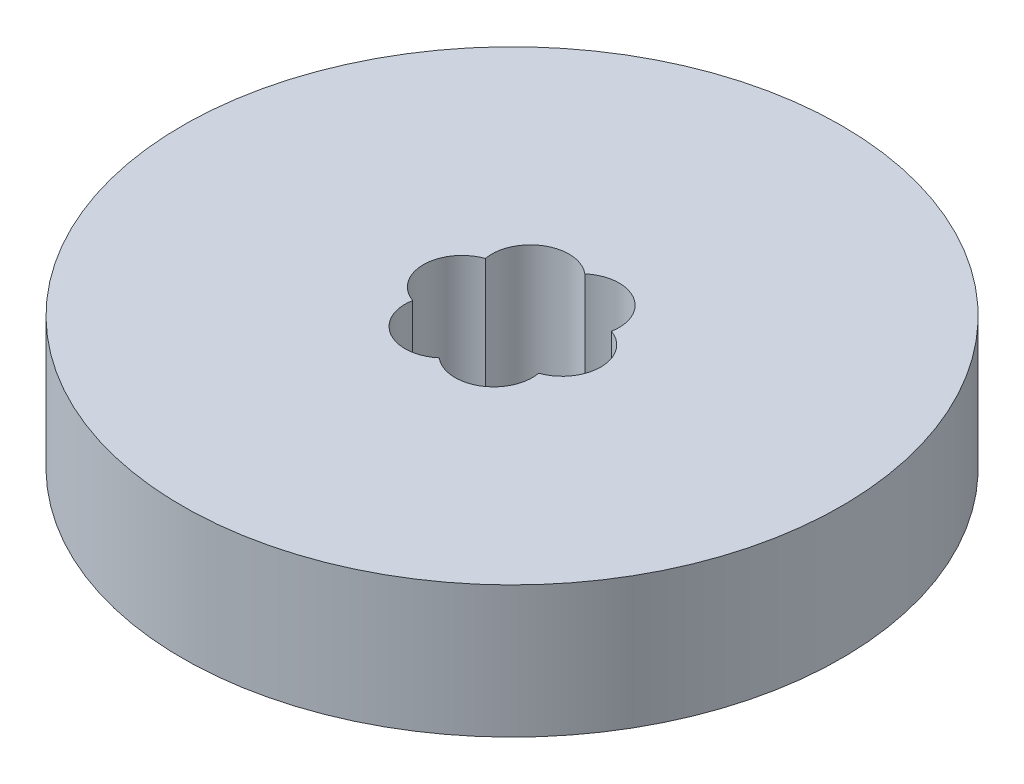
ISO-10303-21;
HEADER;
FILE_DESCRIPTION(('STEP AP214'),'2;1');
FILE_NAME('part.step','',(''),(''),'','','');
FILE_SCHEMA(('AUTOMOTIVE_DESIGN { 1 0 10303 214 1 1 1 1 }'));
ENDSEC;
DATA;
#1=APPLICATION_CONTEXT('core data for automotive mechanical design processes');
#2=APPLICATION_PROTOCOL_DEFINITION('international standard','automotive_design',2000,#1);
#3=PRODUCT_CONTEXT('',#1,'mechanical');
#4=PRODUCT('Part','Part','',(#3));
#5=PRODUCT_RELATED_PRODUCT_CATEGORY('part','',(#4));
#6=PRODUCT_DEFINITION_FORMATION('','',#4);
#7=PRODUCT_DEFINITION_CONTEXT('part definition',#1,'design');
#8=PRODUCT_DEFINITION('design','',#6,#7);
#9=PRODUCT_DEFINITION_SHAPE('','',#8);
#10=(LENGTH_UNIT() NAMED_UNIT(*) SI_UNIT(.MILLI.,.METRE.));
#11=(NAMED_UNIT(*) PLANE_ANGLE_UNIT() SI_UNIT($,.RADIAN.));
#12=(NAMED_UNIT(*) SI_UNIT($,.STERADIAN.) SOLID_ANGLE_UNIT());
#13=UNCERTAINTY_MEASURE_WITH_UNIT(LENGTH_MEASURE(1.E-05),#10,'distance_accuracy_value','');
#14=(GEOMETRIC_REPRESENTATION_CONTEXT(3) GLOBAL_UNCERTAINTY_ASSIGNED_CONTEXT((#13)) GLOBAL_UNIT_ASSIGNED_CONTEXT((#10,
#11,#12)) REPRESENTATION_CONTEXT('',''));
#15=CARTESIAN_POINT('',(0.,0.,0.));
#16=DIRECTION('',(0.,0.,1.));
#17=DIRECTION('',(1.,0.,0.));
#18=AXIS2_PLACEMENT_3D('',#15,#16,#17);
#19=CARTESIAN_POINT('',(0.,13.,0.));
#20=DIRECTION('',(0.,-1.,0.));
#21=DIRECTION('',(0.,0.,-1.));
#22=AXIS2_PLACEMENT_3D('',#19,#20,#21);
#23=CYLINDRICAL_SURFACE('',#22,5.);
#24=CARTESIAN_POINT('',(0.,0.,0.));
#25=DIRECTION('',(0.,1.,0.));
#26=DIRECTION('',(0.,0.,1.));
#27=AXIS2_PLACEMENT_3D('',#24,#25,#26);
#28=CIRCLE('',#27,5.);
#29=CARTESIAN_POINT('',(0.,0.,-5.));
#30=VERTEX_POINT('',#29);
#31=EDGE_CURVE('E142',#30,#30,#28,.T.);
#32=CARTESIAN_POINT('',(0.,0.152622896054144,0.));
#33=DIRECTION('',(0.,1.,0.));
#34=DIRECTION('',(0.,0.,1.));
#35=AXIS2_PLACEMENT_3D('',#32,#33,#34);
#36=CIRCLE('',#35,5.);
#37=CARTESIAN_POINT('',(0.,0.152622896054142,-5.));
#38=VERTEX_POINT('',#37);
#39=EDGE_CURVE('E11',#38,#38,#36,.T.);
#40=CARTESIAN_POINT('',(0.,0.,-5.));
#41=CARTESIAN_POINT('',(0.,0.00158982183389757,-5.));
#42=CARTESIAN_POINT('',(0.,0.00317964366779513,-5.));
#43=CARTESIAN_POINT('',(0.,0.00635928733558969,-5.));
#44=CARTESIAN_POINT('',(0.,0.00794910916948668,-5.));
#45=CARTESIAN_POINT('',(0.,0.0111287528372812,-5.));
#46=CARTESIAN_POINT('',(0.,0.0127185746711788,-5.));
#47=CARTESIAN_POINT('',(0.,0.0158982183389734,-5.));
#48=CARTESIAN_POINT('',(0.,0.0174880401728703,-5.));
#49=CARTESIAN_POINT('',(0.,0.0206676838406649,-5.));
#50=CARTESIAN_POINT('',(0.,0.0222575056745625,-5.));
#51=CARTESIAN_POINT('',(0.,0.025437149342357,-5.));
#52=CARTESIAN_POINT('',(0.,0.027026971176254,-5.));
#53=CARTESIAN_POINT('',(0.,0.0302066148440486,-5.));
#54=CARTESIAN_POINT('',(0.,0.0317964366779461,-5.));
#55=CARTESIAN_POINT('',(0.,0.0349760803457407,-5.));
#56=CARTESIAN_POINT('',(0.,0.0365659021796377,-5.));
#57=CARTESIAN_POINT('',(0.,0.0397455458474322,-5.));
#58=CARTESIAN_POINT('',(0.,0.0413353676813298,-5.));
#59=CARTESIAN_POINT('',(0.,0.0445150113491249,-5.));
#60=CARTESIAN_POINT('',(0.,0.0461048331830225,-5.));
#61=CARTESIAN_POINT('',(0.,0.0492844768508171,-5.));
#62=CARTESIAN_POINT('',(0.,0.0508742986847141,-5.));
#63=CARTESIAN_POINT('',(0.,0.0540539423525086,-5.));
#64=CARTESIAN_POINT('',(0.,0.0556437641864062,-5.));
#65=CARTESIAN_POINT('',(0.,0.0588234078542007,-5.));
#66=CARTESIAN_POINT('',(0.,0.0604132296880977,-5.));
#67=CARTESIAN_POINT('',(0.,0.0635928733558923,-5.));
#68=CARTESIAN_POINT('',(0.,0.0651826951897898,-5.));
#69=CARTESIAN_POINT('',(0.,0.0683623388575844,-5.));
#70=CARTESIAN_POINT('',(0.,0.0699521606914814,-5.));
#71=CARTESIAN_POINT('',(0.,0.073131804359276,-5.));
#72=CARTESIAN_POINT('',(0.,0.0747216261931735,-5.));
#73=CARTESIAN_POINT('',(0.,0.0779012698609687,-5.));
#74=CARTESIAN_POINT('',(0.,0.0794910916948662,-5.));
#75=CARTESIAN_POINT('',(0.,0.0826707353626608,-5.));
#76=CARTESIAN_POINT('',(0.,0.0842605571965578,-5.));
#77=CARTESIAN_POINT('',(0.,0.0874402008643523,-5.));
#78=CARTESIAN_POINT('',(0.,0.0890300226982499,-5.));
#79=CARTESIAN_POINT('',(0.,0.0922096663660444,-5.));
#80=CARTESIAN_POINT('',(0.,0.0937994881999414,-5.));
#81=CARTESIAN_POINT('',(0.,0.096979131867736,-5.));
#82=CARTESIAN_POINT('',(0.,0.0985689537016336,-5.));
#83=CARTESIAN_POINT('',(0.,0.101748597369428,-5.));
#84=CARTESIAN_POINT('',(0.,0.103338419203325,-5.));
#85=CARTESIAN_POINT('',(0.,0.10651806287112,-5.));
#86=CARTESIAN_POINT('',(0.,0.108107884705017,-5.));
#87=CARTESIAN_POINT('',(0.,0.111287528372812,-5.));
#88=CARTESIAN_POINT('',(0.,0.11287735020671,-5.));
#89=CARTESIAN_POINT('',(0.,0.116056993874504,-5.));
#90=CARTESIAN_POINT('',(0.,0.117646815708401,-5.));
#91=CARTESIAN_POINT('',(0.,0.120826459376196,-5.));
#92=CARTESIAN_POINT('',(0.,0.122416281210094,-5.));
#93=CARTESIAN_POINT('',(0.,0.125595924877888,-5.));
#94=CARTESIAN_POINT('',(0.,0.127185746711785,-5.));
#95=CARTESIAN_POINT('',(0.,0.13036539037958,-5.));
#96=CARTESIAN_POINT('',(0.,0.131955212213477,-5.));
#97=CARTESIAN_POINT('',(0.,0.135134855881272,-5.));
#98=CARTESIAN_POINT('',(0.,0.136724677715169,-5.));
#99=CARTESIAN_POINT('',(0.,0.139904321382963,-5.));
#100=CARTESIAN_POINT('',(0.,0.141494143216861,-5.));
#101=CARTESIAN_POINT('',(0.,0.144673786884655,-5.));
#102=CARTESIAN_POINT('',(0.,0.146263608718552,-5.));
#103=CARTESIAN_POINT('',(0.,0.149443252386347,-5.));
#104=CARTESIAN_POINT('',(0.,0.151033074220245,-5.));
#105=CARTESIAN_POINT('',(0.,0.152622896054142,-5.));
#106=B_SPLINE_CURVE_WITH_KNOTS('',3,(#40,#41,#42,#43,#44,#45,#46,#47,#48,#49,#50,#51,#52,#53,
#54,#55,#56,#57,#58,#59,#60,#61,#62,#63,#64,#65,#66,#67,#68,#69,#70,#71,#72,#73,#74,#75,#76,#77,
#78,#79,#80,#81,#82,#83,#84,#85,#86,#87,#88,#89,#90,#91,#92,#93,#94,#95,#96,#97,#98,#99,#100,
#101,#102,#103,#104,#105),.UNSPECIFIED.,.F.,.F.,(4,2,2,2,2,2,2,2,2,2,2,2,2,2,2,2,2,2,2,2,2,2,2,
2,2,2,2,2,2,2,2,2,4),(0.,0.0047694655016927,0.00953893100338367,0.0143083965050764,
0.0190778620067673,0.02384732750846,0.028616793010151,0.0333862585118437,0.0381557240135347,
0.0429251895152274,0.0476946550169201,0.052464120518611,0.0572335860203037,0.0620030515219947,
0.0667725170236874,0.0715419825253784,0.0763114480270711,0.0810809135287638,0.0858503790304548,
0.0906198445321475,0.0953893100338384,0.100158775535531,0.104928241037222,0.109697706538915,
0.114467172040607,0.119236637542298,0.124006103043991,0.128775568545682,0.133545034047375,
0.138314499549066,0.143083965050758,0.147853430552449,0.152622896054142),.UNSPECIFIED.);
#107=EDGE_CURVE('BSEAM39',#30,#38,#106,.T.);
#108=ORIENTED_EDGE('',*,*,#31,.F.);
#109=ORIENTED_EDGE('',*,*,#39,.T.);
#110=ORIENTED_EDGE('',*,*,#107,.T.);
#111=ORIENTED_EDGE('',*,*,#107,.F.);
#112=EDGE_LOOP('',(#108,#110,#109,#111));
#113=FACE_BOUND('',#112,.T.);
#114=ADVANCED_FACE('F39',(#113),#23,.F.);
#115=CARTESIAN_POINT('',(0.,13.,0.));
#116=DIRECTION('',(0.,-1.,0.));
#117=DIRECTION('',(0.,0.,-1.));
#118=AXIS2_PLACEMENT_3D('',#115,#116,#117);
#119=CYLINDRICAL_SURFACE('',#118,32.5);
#120=CARTESIAN_POINT('',(0.,13.,0.));
#121=DIRECTION('',(0.,1.,0.));
#122=DIRECTION('',(0.,0.,1.));
#123=AXIS2_PLACEMENT_3D('',#120,#121,#122);
#124=CIRCLE('',#123,32.5);
#125=CARTESIAN_POINT('',(0.,13.,-32.5));
#126=VERTEX_POINT('',#125);
#127=EDGE_CURVE('E50',#126,#126,#124,.T.);
#128=CARTESIAN_POINT('',(0.,0.,0.));
#129=DIRECTION('',(0.,1.,0.));
#130=DIRECTION('',(0.,0.,1.));
#131=AXIS2_PLACEMENT_3D('',#128,#129,#130);
#132=CIRCLE('',#131,32.5);
#133=CARTESIAN_POINT('',(0.,0.,-32.5));
#134=VERTEX_POINT('',#133);
#135=EDGE_CURVE('E150',#134,#134,#132,.T.);
#136=CARTESIAN_POINT('',(0.,13.,-32.5));
#137=CARTESIAN_POINT('',(0.,12.8645833333333,-32.5));
#138=CARTESIAN_POINT('',(0.,12.7291666666667,-32.5));
#139=CARTESIAN_POINT('',(0.,12.4583333333333,-32.5));
#140=CARTESIAN_POINT('',(0.,12.3229166666667,-32.5));
#141=CARTESIAN_POINT('',(0.,12.0520833333333,-32.5));
#142=CARTESIAN_POINT('',(0.,11.9166666666667,-32.5));
#143=CARTESIAN_POINT('',(0.,11.6458333333333,-32.5));
#144=CARTESIAN_POINT('',(0.,11.5104166666667,-32.5));
#145=CARTESIAN_POINT('',(0.,11.2395833333333,-32.5));
#146=CARTESIAN_POINT('',(0.,11.1041666666667,-32.5));
#147=CARTESIAN_POINT('',(0.,10.8333333333333,-32.5));
#148=CARTESIAN_POINT('',(0.,10.6979166666667,-32.5));
#149=CARTESIAN_POINT('',(0.,10.4270833333333,-32.5));
#150=CARTESIAN_POINT('',(0.,10.2916666666667,-32.5));
#151=CARTESIAN_POINT('',(0.,10.0208333333333,-32.5));
#152=CARTESIAN_POINT('',(0.,9.88541666666667,-32.5));
#153=CARTESIAN_POINT('',(0.,9.61458333333333,-32.5));
#154=CARTESIAN_POINT('',(0.,9.47916666666667,-32.5));
#155=CARTESIAN_POINT('',(0.,9.20833333333333,-32.5));
#156=CARTESIAN_POINT('',(0.,9.07291666666667,-32.5));
#157=CARTESIAN_POINT('',(0.,8.80208333333333,-32.5));
#158=CARTESIAN_POINT('',(0.,8.66666666666667,-32.5));
#159=CARTESIAN_POINT('',(0.,8.39583333333333,-32.5));
#160=CARTESIAN_POINT('',(0.,8.26041666666667,-32.5));
#161=CARTESIAN_POINT('',(0.,7.98958333333333,-32.5));
#162=CARTESIAN_POINT('',(0.,7.85416666666667,-32.5));
#163=CARTESIAN_POINT('',(0.,7.58333333333333,-32.5));
#164=CARTESIAN_POINT('',(0.,7.44791666666667,-32.5));
#165=CARTESIAN_POINT('',(0.,7.17708333333333,-32.5));
#166=CARTESIAN_POINT('',(0.,7.04166666666667,-32.5));
#167=CARTESIAN_POINT('',(0.,6.77083333333333,-32.5));
#168=CARTESIAN_POINT('',(0.,6.63541666666667,-32.5));
#169=CARTESIAN_POINT('',(0.,6.36458333333333,-32.5));
#170=CARTESIAN_POINT('',(0.,6.22916666666667,-32.5));
#171=CARTESIAN_POINT('',(0.,5.95833333333333,-32.5));
#172=CARTESIAN_POINT('',(0.,5.82291666666667,-32.5));
#173=CARTESIAN_POINT('',(0.,5.55208333333333,-32.5));
#174=CARTESIAN_POINT('',(0.,5.41666666666667,-32.5));
#175=CARTESIAN_POINT('',(0.,5.14583333333333,-32.5));
#176=CARTESIAN_POINT('',(0.,5.01041666666667,-32.5));
#177=CARTESIAN_POINT('',(0.,4.73958333333333,-32.5));
#178=CARTESIAN_POINT('',(0.,4.60416666666667,-32.5));
#179=CARTESIAN_POINT('',(0.,4.33333333333333,-32.5));
#180=CARTESIAN_POINT('',(0.,4.19791666666667,-32.5));
#181=CARTESIAN_POINT('',(0.,3.92708333333333,-32.5));
#182=CARTESIAN_POINT('',(0.,3.79166666666667,-32.5));
#183=CARTESIAN_POINT('',(0.,3.52083333333333,-32.5));
#184=CARTESIAN_POINT('',(0.,3.38541666666667,-32.5));
#185=CARTESIAN_POINT('',(0.,3.11458333333333,-32.5));
#186=CARTESIAN_POINT('',(0.,2.97916666666667,-32.5));
#187=CARTESIAN_POINT('',(0.,2.70833333333333,-32.5));
#188=CARTESIAN_POINT('',(0.,2.57291666666667,-32.5));
#189=CARTESIAN_POINT('',(0.,2.30208333333333,-32.5));
#190=CARTESIAN_POINT('',(0.,2.16666666666667,-32.5));
#191=CARTESIAN_POINT('',(0.,1.89583333333333,-32.5));
#192=CARTESIAN_POINT('',(0.,1.76041666666667,-32.5));
#193=CARTESIAN_POINT('',(0.,1.48958333333333,-32.5));
#194=CARTESIAN_POINT('',(0.,1.35416666666667,-32.5));
#195=CARTESIAN_POINT('',(0.,1.08333333333333,-32.5));
#196=CARTESIAN_POINT('',(0.,0.947916666666667,-32.5));
#197=CARTESIAN_POINT('',(0.,0.677083333333334,-32.5));
#198=CARTESIAN_POINT('',(0.,0.541666666666667,-32.5));
#199=CARTESIAN_POINT('',(0.,0.270833333333334,-32.5));
#200=CARTESIAN_POINT('',(0.,0.135416666666667,-32.5));
#201=CARTESIAN_POINT('',(0.,0.,-32.5));
#202=B_SPLINE_CURVE_WITH_KNOTS('',3,(#136,#137,#138,#139,#140,#141,#142,#143,#144,#145,#146,
#147,#148,#149,#150,#151,#152,#153,#154,#155,#156,#157,#158,#159,#160,#161,#162,#163,#164,#165,
#166,#167,#168,#169,#170,#171,#172,#173,#174,#175,#176,#177,#178,#179,#180,#181,#182,#183,#184,
#185,#186,#187,#188,#189,#190,#191,#192,#193,#194,#195,#196,#197,#198,#199,#200,#201),
.UNSPECIFIED.,.F.,.F.,(4,2,2,2,2,2,2,2,2,2,2,2,2,2,2,2,2,2,2,2,2,2,2,2,2,2,2,2,2,2,2,2,4),(0.,
0.406249999999999,0.812499999999999,1.21875,1.625,2.03125,2.4375,2.84375,3.25,3.65625,4.0625,
4.46875,4.875,5.28125,5.6875,6.09375,6.5,6.90625,7.3125,7.71875,8.125,8.53125,8.9375,9.34375,
9.75,10.15625,10.5625,10.96875,11.375,11.78125,12.1875,12.59375,13.),.UNSPECIFIED.);
#203=EDGE_CURVE('BSEAM41',#126,#134,#202,.T.);
#204=ORIENTED_EDGE('',*,*,#127,.F.);
#205=ORIENTED_EDGE('',*,*,#135,.T.);
#206=ORIENTED_EDGE('',*,*,#203,.T.);
#207=ORIENTED_EDGE('',*,*,#203,.F.);
#208=EDGE_LOOP('',(#204,#206,#205,#207));
#209=FACE_BOUND('',#208,.T.);
#210=ADVANCED_FACE('F41',(#209),#119,.T.);
#211=CARTESIAN_POINT('',(0.,13.,0.));
#212=DIRECTION('',(0.,1.,0.));
#213=DIRECTION('',(0.,0.,1.));
#214=AXIS2_PLACEMENT_3D('',#211,#212,#213);
#215=PLANE('',#214);
#216=CARTESIAN_POINT('',(-2.47074132439483,13.,4.27944950621189));
#217=DIRECTION('',(0.,1.,0.));
#218=DIRECTION('',(0.86602540378444,0.,0.499999999999998));
#219=AXIS2_PLACEMENT_3D('',#216,#217,#218);
#220=CIRCLE('',#219,3.80807382384419);
#221=CARTESIAN_POINT('',(-6.21562342646082,13.,3.58859185844851));
#222=VERTEX_POINT('',#221);
#223=CARTESIAN_POINT('',(0.,13.,7.177183716897));
#224=VERTEX_POINT('',#223);
#225=EDGE_CURVE('E132',#222,#224,#220,.T.);
#226=ORIENTED_EDGE('',*,*,#225,.F.);
#227=CARTESIAN_POINT('',(-4.94148264878968,13.,0.));
#228=DIRECTION('',(0.,1.,0.));
#229=DIRECTION('',(0.,0.,1.));
#230=AXIS2_PLACEMENT_3D('',#227,#228,#229);
#231=CIRCLE('',#230,3.80807382384419);
#232=CARTESIAN_POINT('',(-6.21562342646088,13.,-3.58859185844848));
#233=VERTEX_POINT('',#232);
#234=EDGE_CURVE('E138',#233,#222,#231,.T.);
#235=ORIENTED_EDGE('',*,*,#234,.F.);
#236=CARTESIAN_POINT('',(-2.47074132439489,13.,-4.27944950621185));
#237=DIRECTION('',(0.,1.,0.));
#238=DIRECTION('',(-0.866025403784433,0.,0.50000000000001));
#239=AXIS2_PLACEMENT_3D('',#236,#237,#238);
#240=CIRCLE('',#239,3.80807382384419);
#241=CARTESIAN_POINT('',(0.,13.,-7.177183716897));
#242=VERTEX_POINT('',#241);
#243=EDGE_CURVE('E53',#242,#233,#240,.T.);
#244=ORIENTED_EDGE('',*,*,#243,.F.);
#245=CARTESIAN_POINT('',(2.4707413243948,13.,-4.2794495062119));
#246=DIRECTION('',(0.,1.,0.));
#247=DIRECTION('',(-0.866025403784443,0.,-0.499999999999992));
#248=AXIS2_PLACEMENT_3D('',#245,#246,#247);
#249=CIRCLE('',#248,3.80807382384419);
#250=CARTESIAN_POINT('',(6.21562342646078,13.,-3.58859185844852));
#251=VERTEX_POINT('',#250);
#252=EDGE_CURVE('E106',#251,#242,#249,.T.);
#253=ORIENTED_EDGE('',*,*,#252,.F.);
#254=CARTESIAN_POINT('',(4.94148264878968,13.,0.));
#255=DIRECTION('',(0.,1.,0.));
#256=DIRECTION('',(0.,0.,-1.));
#257=AXIS2_PLACEMENT_3D('',#254,#255,#256);
#258=CIRCLE('',#257,3.80807382384419);
#259=CARTESIAN_POINT('',(6.21562342646085,13.,3.5885918584485));
#260=VERTEX_POINT('',#259);
#261=EDGE_CURVE('E104',#260,#251,#258,.T.);
#262=ORIENTED_EDGE('',*,*,#261,.F.);
#263=CARTESIAN_POINT('',(2.47074132439486,13.,4.27944950621187));
#264=DIRECTION('',(0.,1.,0.));
#265=DIRECTION('',(0.866025403784436,0.,-0.500000000000004));
#266=AXIS2_PLACEMENT_3D('',#263,#264,#265);
#267=CIRCLE('',#266,3.80807382384419);
#268=EDGE_CURVE('E123',#224,#260,#267,.T.);
#269=ORIENTED_EDGE('',*,*,#268,.F.);
#270=EDGE_LOOP('',(#226,#235,#244,#253,#262,#269));
#271=FACE_BOUND('',#270,.T.);
#272=ORIENTED_EDGE('',*,*,#127,.T.);
#273=EDGE_LOOP('',(#272));
#274=FACE_BOUND('',#273,.T.);
#275=ADVANCED_FACE('F156',(#271,#274),#215,.T.);
#276=CARTESIAN_POINT('',(0.,0.,0.));
#277=DIRECTION('',(0.,1.,0.));
#278=DIRECTION('',(0.,0.,1.));
#279=AXIS2_PLACEMENT_3D('',#276,#277,#278);
#280=PLANE('',#279);
#281=ORIENTED_EDGE('',*,*,#31,.T.);
#282=EDGE_LOOP('',(#281));
#283=FACE_BOUND('',#282,.T.);
#284=ORIENTED_EDGE('',*,*,#135,.F.);
#285=EDGE_LOOP('',(#284));
#286=FACE_BOUND('',#285,.T.);
#287=ADVANCED_FACE('F153',(#283,#286),#280,.F.);
#288=CARTESIAN_POINT('',(-4.94148264878968,0.152622896054144,0.));
#289=DIRECTION('',(0.,1.,0.));
#290=DIRECTION('',(0.,0.,1.));
#291=AXIS2_PLACEMENT_3D('',#288,#289,#290);
#292=CYLINDRICAL_SURFACE('',#291,3.80807382384419);
#293=ORIENTED_EDGE('',*,*,#234,.T.);
#294=DIRECTION('',(0.,1.,0.));
#295=VECTOR('',#294,1.);
#296=CARTESIAN_POINT('',(-6.21562342646082,6.57631144802707,3.58859185844851));
#297=LINE('',#296,#295);
#298=CARTESIAN_POINT('',(-6.21562342646082,0.152622896054144,3.58859185844851));
#299=VERTEX_POINT('',#298);
#300=EDGE_CURVE('E65',#222,#299,#297,.F.);
#301=ORIENTED_EDGE('',*,*,#300,.T.);
#302=CARTESIAN_POINT('',(-4.94148264878968,0.152622896054144,0.));
#303=DIRECTION('',(0.,1.,0.));
#304=DIRECTION('',(0.,0.,1.));
#305=AXIS2_PLACEMENT_3D('',#302,#303,#304);
#306=CIRCLE('',#305,3.80807382384419);
#307=CARTESIAN_POINT('',(-6.21562342646088,0.152622896054144,-3.58859185844848));
#308=VERTEX_POINT('',#307);
#309=EDGE_CURVE('E139',#308,#299,#306,.T.);
#310=ORIENTED_EDGE('',*,*,#309,.F.);
#311=DIRECTION('',(0.,1.,0.));
#312=VECTOR('',#311,1.);
#313=CARTESIAN_POINT('',(-6.21562342646088,6.57631144802707,-3.58859185844848));
#314=LINE('',#313,#312);
#315=EDGE_CURVE('E114',#308,#233,#314,.T.);
#316=ORIENTED_EDGE('',*,*,#315,.T.);
#317=EDGE_LOOP('',(#293,#301,#310,#316));
#318=FACE_BOUND('',#317,.T.);
#319=ADVANCED_FACE('F154',(#318),#292,.F.);
#320=CARTESIAN_POINT('',(-4.94148264878968,0.152622896054144,0.));
#321=DIRECTION('',(0.,1.,0.));
#322=DIRECTION('',(0.,0.,1.));
#323=AXIS2_PLACEMENT_3D('',#320,#321,#322);
#324=PLANE('',#323);
#325=ORIENTED_EDGE('',*,*,#309,.T.);
#326=CARTESIAN_POINT('',(-2.47074132439483,0.152622896054144,4.27944950621189));
#327=DIRECTION('',(0.,1.,0.));
#328=DIRECTION('',(0.86602540378444,0.,0.499999999999998));
#329=AXIS2_PLACEMENT_3D('',#326,#327,#328);
#330=CIRCLE('',#329,3.80807382384419);
#331=CARTESIAN_POINT('',(0.,0.152622896054144,7.177183716897));
#332=VERTEX_POINT('',#331);
#333=EDGE_CURVE('E133',#299,#332,#330,.T.);
#334=ORIENTED_EDGE('',*,*,#333,.T.);
#335=CARTESIAN_POINT('',(2.47074132439486,0.152622896054144,4.27944950621187));
#336=DIRECTION('',(0.,1.,0.));
#337=DIRECTION('',(0.866025403784436,0.,-0.500000000000004));
#338=AXIS2_PLACEMENT_3D('',#335,#336,#337);
#339=CIRCLE('',#338,3.80807382384419);
#340=CARTESIAN_POINT('',(6.21562342646085,0.152622896054144,3.5885918584485));
#341=VERTEX_POINT('',#340);
#342=EDGE_CURVE('E124',#332,#341,#339,.T.);
#343=ORIENTED_EDGE('',*,*,#342,.T.);
#344=CARTESIAN_POINT('',(4.94148264878968,0.152622896054144,0.));
#345=DIRECTION('',(0.,1.,0.));
#346=DIRECTION('',(0.,0.,-1.));
#347=AXIS2_PLACEMENT_3D('',#344,#345,#346);
#348=CIRCLE('',#347,3.80807382384419);
#349=CARTESIAN_POINT('',(6.21562342646078,0.152622896054144,-3.58859185844852));
#350=VERTEX_POINT('',#349);
#351=EDGE_CURVE('E105',#341,#350,#348,.T.);
#352=ORIENTED_EDGE('',*,*,#351,.T.);
#353=CARTESIAN_POINT('',(2.4707413243948,0.152622896054144,-4.2794495062119));
#354=DIRECTION('',(0.,1.,0.));
#355=DIRECTION('',(-0.866025403784443,0.,-0.499999999999992));
#356=AXIS2_PLACEMENT_3D('',#353,#354,#355);
#357=CIRCLE('',#356,3.80807382384419);
#358=CARTESIAN_POINT('',(0.,0.152622896054144,-7.177183716897));
#359=VERTEX_POINT('',#358);
#360=EDGE_CURVE('E91',#350,#359,#357,.T.);
#361=ORIENTED_EDGE('',*,*,#360,.T.);
#362=CARTESIAN_POINT('',(-2.47074132439489,0.152622896054144,-4.27944950621185));
#363=DIRECTION('',(0.,1.,0.));
#364=DIRECTION('',(-0.866025403784433,0.,0.50000000000001));
#365=AXIS2_PLACEMENT_3D('',#362,#363,#364);
#366=CIRCLE('',#365,3.80807382384419);
#367=EDGE_CURVE('E97',#359,#308,#366,.T.);
#368=ORIENTED_EDGE('',*,*,#367,.T.);
#369=EDGE_LOOP('',(#325,#334,#343,#352,#361,#368));
#370=FACE_BOUND('',#369,.T.);
#371=ORIENTED_EDGE('',*,*,#39,.F.);
#372=EDGE_LOOP('',(#371));
#373=FACE_BOUND('',#372,.T.);
#374=ADVANCED_FACE('F96',(#370,#373),#324,.T.);
#375=CARTESIAN_POINT('',(-2.47074132439483,0.152622896054144,4.27944950621189));
#376=DIRECTION('',(0.,1.,0.));
#377=DIRECTION('',(0.,0.,1.));
#378=AXIS2_PLACEMENT_3D('',#375,#376,#377);
#379=CYLINDRICAL_SURFACE('',#378,3.80807382384419);
#380=ORIENTED_EDGE('',*,*,#225,.T.);
#381=DIRECTION('',(0.,1.,0.));
#382=VECTOR('',#381,1.);
#383=CARTESIAN_POINT('',(0.,6.57631144802707,7.177183716897));
#384=LINE('',#383,#382);
#385=EDGE_CURVE('E128',#224,#332,#384,.F.);
#386=ORIENTED_EDGE('',*,*,#385,.T.);
#387=ORIENTED_EDGE('',*,*,#333,.F.);
#388=ORIENTED_EDGE('',*,*,#300,.F.);
#389=EDGE_LOOP('',(#380,#386,#387,#388));
#390=FACE_BOUND('',#389,.T.);
#391=ADVANCED_FACE('F177',(#390),#379,.F.);
#392=CARTESIAN_POINT('',(-2.47074132439489,0.152622896054144,-4.27944950621185));
#393=DIRECTION('',(0.,1.,0.));
#394=DIRECTION('',(0.,0.,1.));
#395=AXIS2_PLACEMENT_3D('',#392,#393,#394);
#396=CYLINDRICAL_SURFACE('',#395,3.80807382384419);
#397=ORIENTED_EDGE('',*,*,#367,.F.);
#398=DIRECTION('',(0.,1.,0.));
#399=VECTOR('',#398,1.);
#400=CARTESIAN_POINT('',(0.,6.57631144802707,-7.177183716897));
#401=LINE('',#400,#399);
#402=EDGE_CURVE('E107',#242,#359,#401,.F.);
#403=ORIENTED_EDGE('',*,*,#402,.F.);
#404=ORIENTED_EDGE('',*,*,#243,.T.);
#405=ORIENTED_EDGE('',*,*,#315,.F.);
#406=EDGE_LOOP('',(#397,#403,#404,#405));
#407=FACE_BOUND('',#406,.T.);
#408=ADVANCED_FACE('F115',(#407),#396,.F.);
#409=CARTESIAN_POINT('',(2.47074132439486,0.152622896054144,4.27944950621187));
#410=DIRECTION('',(0.,1.,0.));
#411=DIRECTION('',(0.,0.,1.));
#412=AXIS2_PLACEMENT_3D('',#409,#410,#411);
#413=CYLINDRICAL_SURFACE('',#412,3.80807382384419);
#414=ORIENTED_EDGE('',*,*,#268,.T.);
#415=DIRECTION('',(0.,1.,0.));
#416=VECTOR('',#415,1.);
#417=CARTESIAN_POINT('',(6.21562342646085,6.57631144802707,3.5885918584485));
#418=LINE('',#417,#416);
#419=EDGE_CURVE('E118',#260,#341,#418,.F.);
#420=ORIENTED_EDGE('',*,*,#419,.T.);
#421=ORIENTED_EDGE('',*,*,#342,.F.);
#422=ORIENTED_EDGE('',*,*,#385,.F.);
#423=EDGE_LOOP('',(#414,#420,#421,#422));
#424=FACE_BOUND('',#423,.T.);
#425=ADVANCED_FACE('F182',(#424),#413,.F.);
#426=CARTESIAN_POINT('',(4.94148264878968,0.152622896054144,0.));
#427=DIRECTION('',(0.,1.,0.));
#428=DIRECTION('',(0.,0.,1.));
#429=AXIS2_PLACEMENT_3D('',#426,#427,#428);
#430=CYLINDRICAL_SURFACE('',#429,3.80807382384419);
#431=DIRECTION('',(0.,1.,0.));
#432=VECTOR('',#431,1.);
#433=CARTESIAN_POINT('',(6.21562342646079,6.57631144802707,-3.58859185844852));
#434=LINE('',#433,#432);
#435=EDGE_CURVE('E130',#251,#350,#434,.F.);
#436=ORIENTED_EDGE('',*,*,#435,.T.);
#437=ORIENTED_EDGE('',*,*,#351,.F.);
#438=ORIENTED_EDGE('',*,*,#419,.F.);
#439=ORIENTED_EDGE('',*,*,#261,.T.);
#440=EDGE_LOOP('',(#436,#437,#438,#439));
#441=FACE_BOUND('',#440,.T.);
#442=ADVANCED_FACE('F184',(#441),#430,.F.);
#443=CARTESIAN_POINT('',(2.4707413243948,0.152622896054144,-4.2794495062119));
#444=DIRECTION('',(0.,1.,0.));
#445=DIRECTION('',(0.,0.,1.));
#446=AXIS2_PLACEMENT_3D('',#443,#444,#445);
#447=CYLINDRICAL_SURFACE('',#446,3.80807382384419);
#448=ORIENTED_EDGE('',*,*,#252,.T.);
#449=ORIENTED_EDGE('',*,*,#402,.T.);
#450=ORIENTED_EDGE('',*,*,#360,.F.);
#451=ORIENTED_EDGE('',*,*,#435,.F.);
#452=EDGE_LOOP('',(#448,#449,#450,#451));
#453=FACE_BOUND('',#452,.T.);
#454=ADVANCED_FACE('F108',(#453),#447,.F.);
#455=CLOSED_SHELL('',(#114,#210,#275,#287,#319,#374,#391,#408,#425,#442,#454));
#456=MANIFOLD_SOLID_BREP('B2',#455);
#457=ADVANCED_BREP_SHAPE_REPRESENTATION('',(#18,#456),#14);
#458=SHAPE_DEFINITION_REPRESENTATION(#9,#457);
ENDSEC;
END-ISO-10303-21;
